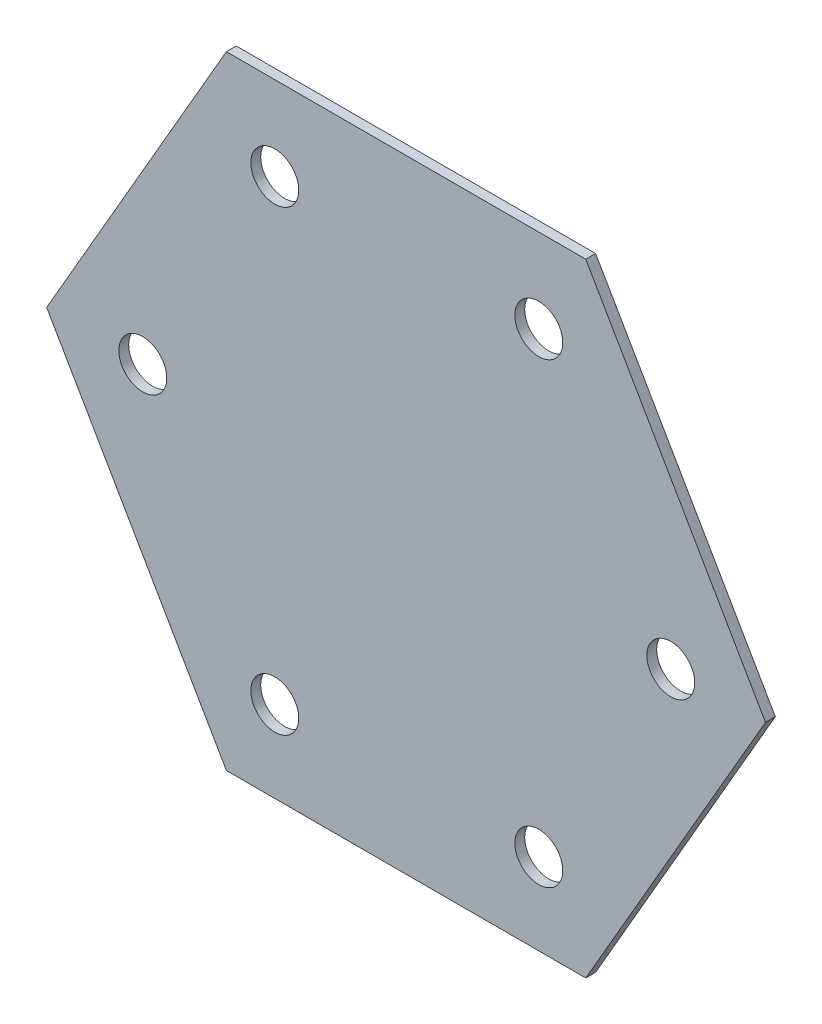
ISO-10303-21;
HEADER;
FILE_DESCRIPTION(('STEP AP214'),'2;1');
FILE_NAME('part.step','',(''),(''),'','','');
FILE_SCHEMA(('AUTOMOTIVE_DESIGN { 1 0 10303 214 1 1 1 1 }'));
ENDSEC;
DATA;
#1=APPLICATION_CONTEXT('core data for automotive mechanical design processes');
#2=APPLICATION_PROTOCOL_DEFINITION('international standard','automotive_design',2000,#1);
#3=PRODUCT_CONTEXT('',#1,'mechanical');
#4=PRODUCT('Part','Part','',(#3));
#5=PRODUCT_RELATED_PRODUCT_CATEGORY('part','',(#4));
#6=PRODUCT_DEFINITION_FORMATION('','',#4);
#7=PRODUCT_DEFINITION_CONTEXT('part definition',#1,'design');
#8=PRODUCT_DEFINITION('design','',#6,#7);
#9=PRODUCT_DEFINITION_SHAPE('','',#8);
#10=(LENGTH_UNIT() NAMED_UNIT(*) SI_UNIT(.MILLI.,.METRE.));
#11=(NAMED_UNIT(*) PLANE_ANGLE_UNIT() SI_UNIT($,.RADIAN.));
#12=(NAMED_UNIT(*) SI_UNIT($,.STERADIAN.) SOLID_ANGLE_UNIT());
#13=UNCERTAINTY_MEASURE_WITH_UNIT(LENGTH_MEASURE(1.E-05),#10,'distance_accuracy_value','');
#14=(GEOMETRIC_REPRESENTATION_CONTEXT(3) GLOBAL_UNCERTAINTY_ASSIGNED_CONTEXT((#13)) GLOBAL_UNIT_ASSIGNED_CONTEXT((#10,
#11,#12)) REPRESENTATION_CONTEXT('',''));
#15=CARTESIAN_POINT('',(0.,0.,0.));
#16=DIRECTION('',(0.,0.,1.));
#17=DIRECTION('',(1.,0.,0.));
#18=AXIS2_PLACEMENT_3D('',#15,#16,#17);
#19=CARTESIAN_POINT('',(22.5,12.989999771118,0.));
#20=DIRECTION('',(0.,0.,-1.));
#21=DIRECTION('',(-1.,0.,0.));
#22=AXIS2_PLACEMENT_3D('',#19,#20,#21);
#23=PLANE('',#22);
#24=CARTESIAN_POINT('',(18.5474864,12.93902416,0.));
#25=DIRECTION('',(0.,0.,-1.));
#26=DIRECTION('',(-1.,0.,0.));
#27=AXIS2_PLACEMENT_3D('',#24,#25,#26);
#28=CIRCLE('',#27,1.00000054);
#29=CARTESIAN_POINT('',(17.54748586,12.93902416,0.));
#30=VERTEX_POINT('',#29);
#31=EDGE_CURVE('E125',#30,#30,#28,.T.);
#32=ORIENTED_EDGE('',*,*,#31,.T.);
#33=EDGE_LOOP('',(#32));
#34=FACE_BOUND('',#33,.T.);
#35=CARTESIAN_POINT('',(13.03865312,22.48086944,0.));
#36=DIRECTION('',(0.,0.,-1.));
#37=DIRECTION('',(-1.,0.,0.));
#38=AXIS2_PLACEMENT_3D('',#35,#36,#37);
#39=CIRCLE('',#38,1.00000054);
#40=CARTESIAN_POINT('',(12.03865258,22.48086944,0.));
#41=VERTEX_POINT('',#40);
#42=EDGE_CURVE('E131',#41,#41,#39,.T.);
#43=ORIENTED_EDGE('',*,*,#42,.T.);
#44=EDGE_LOOP('',(#43));
#45=FACE_BOUND('',#44,.T.);
#46=CARTESIAN_POINT('',(13.03844992,3.39732112,0.));
#47=DIRECTION('',(0.,0.,-1.));
#48=DIRECTION('',(-1.,0.,0.));
#49=AXIS2_PLACEMENT_3D('',#46,#47,#48);
#50=CIRCLE('',#49,1.00000054);
#51=CARTESIAN_POINT('',(12.03844938,3.39732112,0.));
#52=VERTEX_POINT('',#51);
#53=EDGE_CURVE('E140',#52,#52,#50,.T.);
#54=ORIENTED_EDGE('',*,*,#53,.T.);
#55=EDGE_LOOP('',(#54));
#56=FACE_BOUND('',#55,.T.);
#57=CARTESIAN_POINT('',(2.02078336,22.48101168,0.));
#58=DIRECTION('',(0.,0.,-1.));
#59=DIRECTION('',(-1.,0.,0.));
#60=AXIS2_PLACEMENT_3D('',#57,#58,#59);
#61=CIRCLE('',#60,1.00000054);
#62=CARTESIAN_POINT('',(1.02078282,22.48101168,0.));
#63=VERTEX_POINT('',#62);
#64=EDGE_CURVE('E144',#63,#63,#61,.T.);
#65=ORIENTED_EDGE('',*,*,#64,.T.);
#66=EDGE_LOOP('',(#65));
#67=FACE_BOUND('',#66,.T.);
#68=CARTESIAN_POINT('',(-3.48829376,12.93928832,0.));
#69=DIRECTION('',(0.,0.,-1.));
#70=DIRECTION('',(-1.,0.,0.));
#71=AXIS2_PLACEMENT_3D('',#68,#69,#70);
#72=CIRCLE('',#71,1.00000054);
#73=CARTESIAN_POINT('',(-4.4882943,12.93928832,0.));
#74=VERTEX_POINT('',#73);
#75=EDGE_CURVE('E148',#74,#74,#72,.T.);
#76=ORIENTED_EDGE('',*,*,#75,.T.);
#77=EDGE_LOOP('',(#76));
#78=FACE_BOUND('',#77,.T.);
#79=CARTESIAN_POINT('',(2.02053952,3.39746336,0.));
#80=DIRECTION('',(0.,0.,-1.));
#81=DIRECTION('',(-1.,0.,0.));
#82=AXIS2_PLACEMENT_3D('',#79,#80,#81);
#83=CIRCLE('',#82,1.00000054);
#84=CARTESIAN_POINT('',(1.02053898,3.39746336,0.));
#85=VERTEX_POINT('',#84);
#86=EDGE_CURVE('E23',#85,#85,#83,.T.);
#87=ORIENTED_EDGE('',*,*,#86,.T.);
#88=EDGE_LOOP('',(#87));
#89=FACE_BOUND('',#88,.T.);
#90=DIRECTION('',(1.,0.,0.));
#91=VECTOR('',#90,1.);
#92=CARTESIAN_POINT('',(15.,25.981000900269,0.));
#93=LINE('',#92,#91);
#94=CARTESIAN_POINT('',(14.9999999999999,25.9810009002689,0.));
#95=VERTEX_POINT('',#94);
#96=CARTESIAN_POINT('',(0.,25.981000900269,0.));
#97=VERTEX_POINT('',#96);
#98=EDGE_CURVE('E163',#95,#97,#93,.F.);
#99=ORIENTED_EDGE('',*,*,#98,.T.);
#100=DIRECTION('',(0.499982100586129,0.866035737769223,0.));
#101=VECTOR('',#100,1.);
#102=CARTESIAN_POINT('',(0.,25.981000900269,0.));
#103=LINE('',#102,#101);
#104=CARTESIAN_POINT('',(-7.50000000000011,12.9899997711181,0.));
#105=VERTEX_POINT('',#104);
#106=EDGE_CURVE('E169',#97,#105,#103,.F.);
#107=ORIENTED_EDGE('',*,*,#106,.T.);
#108=DIRECTION('',(-0.500011006970785,0.866019048813628,0.));
#109=VECTOR('',#108,1.);
#110=CARTESIAN_POINT('',(-7.5,12.989999771118,0.));
#111=LINE('',#110,#109);
#112=CARTESIAN_POINT('',(1.03085940650496E-12,5.97496044059143E-13,0.));
#113=VERTEX_POINT('',#112);
#114=EDGE_CURVE('E73',#105,#113,#111,.F.);
#115=ORIENTED_EDGE('',*,*,#114,.T.);
#116=DIRECTION('',(1.,0.,0.));
#117=VECTOR('',#116,1.);
#118=CARTESIAN_POINT('',(0.,0.,0.));
#119=LINE('',#118,#117);
#120=CARTESIAN_POINT('',(15.,0.,0.));
#121=VERTEX_POINT('',#120);
#122=EDGE_CURVE('E75',#113,#121,#119,.T.);
#123=ORIENTED_EDGE('',*,*,#122,.T.);
#124=DIRECTION('',(-0.500011006970785,-0.866019048813628,0.));
#125=VECTOR('',#124,1.);
#126=CARTESIAN_POINT('',(15.,0.,0.));
#127=LINE('',#126,#125);
#128=CARTESIAN_POINT('',(22.5000000000021,12.9899997711168,0.));
#129=VERTEX_POINT('',#128);
#130=EDGE_CURVE('E77',#121,#129,#127,.F.);
#131=ORIENTED_EDGE('',*,*,#130,.T.);
#132=DIRECTION('',(0.499982100586129,-0.866035737769223,0.));
#133=VECTOR('',#132,1.);
#134=CARTESIAN_POINT('',(22.5,12.989999771118,0.));
#135=LINE('',#134,#133);
#136=EDGE_CURVE('E157',#129,#95,#135,.F.);
#137=ORIENTED_EDGE('',*,*,#136,.T.);
#138=EDGE_LOOP('',(#99,#107,#115,#123,#131,#137));
#139=FACE_BOUND('',#138,.T.);
#140=ADVANCED_FACE('F20',(#34,#45,#56,#67,#78,#89,#139),#23,.F.);
#141=CARTESIAN_POINT('',(15.,0.,-0.41148));
#142=DIRECTION('',(-0.866019048813628,0.500011006970785,0.));
#143=DIRECTION('',(-0.500011006970785,-0.866019048813628,0.));
#144=AXIS2_PLACEMENT_3D('',#141,#142,#143);
#145=PLANE('',#144);
#146=DIRECTION('',(0.,0.,1.));
#147=VECTOR('',#146,1.);
#148=CARTESIAN_POINT('',(22.5,12.989999771118,-0.41148));
#149=LINE('',#148,#147);
#150=CARTESIAN_POINT('',(22.5000000000021,12.9899997711168,-0.41148));
#151=VERTEX_POINT('',#150);
#152=EDGE_CURVE('E89',#151,#129,#149,.T.);
#153=ORIENTED_EDGE('',*,*,#152,.T.);
#154=ORIENTED_EDGE('',*,*,#130,.F.);
#155=DIRECTION('',(0.,0.,1.));
#156=VECTOR('',#155,1.);
#157=CARTESIAN_POINT('',(15.,0.,-0.41148));
#158=LINE('',#157,#156);
#159=CARTESIAN_POINT('',(15.,0.,-0.41148));
#160=VERTEX_POINT('',#159);
#161=EDGE_CURVE('E83',#121,#160,#158,.F.);
#162=ORIENTED_EDGE('',*,*,#161,.T.);
#163=DIRECTION('',(-0.50001100697051,-0.866019048813787,0.));
#164=VECTOR('',#163,1.);
#165=CARTESIAN_POINT('',(22.5,12.989999771118,-0.41148));
#166=LINE('',#165,#164);
#167=EDGE_CURVE('E130',#151,#160,#166,.T.);
#168=ORIENTED_EDGE('',*,*,#167,.F.);
#169=EDGE_LOOP('',(#153,#154,#162,#168));
#170=FACE_BOUND('',#169,.T.);
#171=ADVANCED_FACE('F86',(#170),#145,.F.);
#172=CARTESIAN_POINT('',(0.,0.,-0.41148));
#173=DIRECTION('',(0.,1.,0.));
#174=DIRECTION('',(0.,0.,1.));
#175=AXIS2_PLACEMENT_3D('',#172,#173,#174);
#176=PLANE('',#175);
#177=ORIENTED_EDGE('',*,*,#161,.F.);
#178=ORIENTED_EDGE('',*,*,#122,.F.);
#179=DIRECTION('',(0.,0.,1.));
#180=VECTOR('',#179,1.);
#181=CARTESIAN_POINT('',(4.13384604325273E-12,2.38351005599213E-12,-0.41148));
#182=LINE('',#181,#180);
#183=CARTESIAN_POINT('',(1.03259413952806E-12,5.958194172906E-13,-0.41148));
#184=VERTEX_POINT('',#183);
#185=EDGE_CURVE('E101',#113,#184,#182,.F.);
#186=ORIENTED_EDGE('',*,*,#185,.T.);
#187=DIRECTION('',(-1.,0.,0.));
#188=VECTOR('',#187,1.);
#189=CARTESIAN_POINT('',(22.5,0.,-0.41148));
#190=LINE('',#189,#188);
#191=EDGE_CURVE('E95',#160,#184,#190,.T.);
#192=ORIENTED_EDGE('',*,*,#191,.F.);
#193=EDGE_LOOP('',(#177,#178,#186,#192));
#194=FACE_BOUND('',#193,.T.);
#195=ADVANCED_FACE('F93',(#194),#176,.F.);
#196=CARTESIAN_POINT('',(-7.5,12.989999771118,-0.41148));
#197=DIRECTION('',(0.866019048813628,0.500011006970785,0.));
#198=DIRECTION('',(-0.500011006970785,0.866019048813628,0.));
#199=AXIS2_PLACEMENT_3D('',#196,#197,#198);
#200=PLANE('',#199);
#201=ORIENTED_EDGE('',*,*,#185,.F.);
#202=ORIENTED_EDGE('',*,*,#114,.F.);
#203=DIRECTION('',(0.,0.,1.));
#204=VECTOR('',#203,1.);
#205=CARTESIAN_POINT('',(-7.50000000000045,12.9899997711183,-0.41148));
#206=LINE('',#205,#204);
#207=CARTESIAN_POINT('',(-7.50000000000011,12.9899997711181,-0.41148));
#208=VERTEX_POINT('',#207);
#209=EDGE_CURVE('E166',#105,#208,#206,.F.);
#210=ORIENTED_EDGE('',*,*,#209,.T.);
#211=DIRECTION('',(-0.50001100697051,0.866019048813787,0.));
#212=VECTOR('',#211,1.);
#213=CARTESIAN_POINT('',(0.,0.,-0.41148));
#214=LINE('',#213,#212);
#215=EDGE_CURVE('E175',#184,#208,#214,.T.);
#216=ORIENTED_EDGE('',*,*,#215,.F.);
#217=EDGE_LOOP('',(#201,#202,#210,#216));
#218=FACE_BOUND('',#217,.T.);
#219=ADVANCED_FACE('F176',(#218),#200,.F.);
#220=CARTESIAN_POINT('',(0.,25.981000900269,-0.41148));
#221=DIRECTION('',(0.866035737769223,-0.499982100586129,0.));
#222=DIRECTION('',(0.499982100586129,0.866035737769223,0.));
#223=AXIS2_PLACEMENT_3D('',#220,#221,#222);
#224=PLANE('',#223);
#225=ORIENTED_EDGE('',*,*,#209,.F.);
#226=ORIENTED_EDGE('',*,*,#106,.F.);
#227=DIRECTION('',(0.,0.,-1.));
#228=VECTOR('',#227,1.);
#229=CARTESIAN_POINT('',(0.,25.981000900269,-0.41148));
#230=LINE('',#229,#228);
#231=CARTESIAN_POINT('',(0.,25.981000900269,-0.41148));
#232=VERTEX_POINT('',#231);
#233=EDGE_CURVE('E158',#97,#232,#230,.T.);
#234=ORIENTED_EDGE('',*,*,#233,.T.);
#235=DIRECTION('',(0.499982100586099,0.86603573776924,0.));
#236=VECTOR('',#235,1.);
#237=CARTESIAN_POINT('',(-7.5,12.989999771118,-0.41148));
#238=LINE('',#237,#236);
#239=EDGE_CURVE('E182',#208,#232,#238,.T.);
#240=ORIENTED_EDGE('',*,*,#239,.F.);
#241=EDGE_LOOP('',(#225,#226,#234,#240));
#242=FACE_BOUND('',#241,.T.);
#243=ADVANCED_FACE('F210',(#242),#224,.F.);
#244=CARTESIAN_POINT('',(15.,25.981000900269,-0.41148));
#245=DIRECTION('',(0.,-1.,0.));
#246=DIRECTION('',(0.,0.,-1.));
#247=AXIS2_PLACEMENT_3D('',#244,#245,#246);
#248=PLANE('',#247);
#249=ORIENTED_EDGE('',*,*,#233,.F.);
#250=ORIENTED_EDGE('',*,*,#98,.F.);
#251=DIRECTION('',(0.,0.,1.));
#252=VECTOR('',#251,1.);
#253=CARTESIAN_POINT('',(14.9999999999996,25.9810009002687,-0.41148));
#254=LINE('',#253,#252);
#255=CARTESIAN_POINT('',(14.9999999999999,25.9810009002689,-0.41148));
#256=VERTEX_POINT('',#255);
#257=EDGE_CURVE('E40',#95,#256,#254,.F.);
#258=ORIENTED_EDGE('',*,*,#257,.T.);
#259=DIRECTION('',(-1.,0.,0.));
#260=VECTOR('',#259,1.);
#261=CARTESIAN_POINT('',(22.5,25.981000900269,-0.41148));
#262=LINE('',#261,#260);
#263=EDGE_CURVE('E202',#232,#256,#262,.F.);
#264=ORIENTED_EDGE('',*,*,#263,.F.);
#265=EDGE_LOOP('',(#249,#250,#258,#264));
#266=FACE_BOUND('',#265,.T.);
#267=ADVANCED_FACE('F199',(#266),#248,.F.);
#268=CARTESIAN_POINT('',(22.5,12.989999771118,-0.41148));
#269=DIRECTION('',(-0.866035737769223,-0.499982100586129,0.));
#270=DIRECTION('',(0.499982100586129,-0.866035737769223,0.));
#271=AXIS2_PLACEMENT_3D('',#268,#269,#270);
#272=PLANE('',#271);
#273=ORIENTED_EDGE('',*,*,#257,.F.);
#274=ORIENTED_EDGE('',*,*,#136,.F.);
#275=ORIENTED_EDGE('',*,*,#152,.F.);
#276=DIRECTION('',(0.499982100586099,-0.86603573776924,0.));
#277=VECTOR('',#276,1.);
#278=CARTESIAN_POINT('',(15.,25.981000900269,-0.41148));
#279=LINE('',#278,#277);
#280=EDGE_CURVE('E124',#256,#151,#279,.T.);
#281=ORIENTED_EDGE('',*,*,#280,.F.);
#282=EDGE_LOOP('',(#273,#274,#275,#281));
#283=FACE_BOUND('',#282,.T.);
#284=ADVANCED_FACE('F200',(#283),#272,.F.);
#285=CARTESIAN_POINT('',(2.02053952,3.39746336,-0.41148));
#286=DIRECTION('',(0.,0.,-1.));
#287=DIRECTION('',(-1.,0.,0.));
#288=AXIS2_PLACEMENT_3D('',#285,#286,#287);
#289=CYLINDRICAL_SURFACE('',#288,1.00000054);
#290=ORIENTED_EDGE('',*,*,#86,.F.);
#291=EDGE_LOOP('',(#290));
#292=FACE_BOUND('',#291,.T.);
#293=CARTESIAN_POINT('',(2.02053952,3.39746336,-0.41148));
#294=DIRECTION('',(0.,0.,-1.));
#295=DIRECTION('',(-1.,0.,0.));
#296=AXIS2_PLACEMENT_3D('',#293,#294,#295);
#297=CIRCLE('',#296,1.00000054);
#298=CARTESIAN_POINT('',(1.02053898,3.39746336,-0.41148));
#299=VERTEX_POINT('',#298);
#300=EDGE_CURVE('E120',#299,#299,#297,.F.);
#301=ORIENTED_EDGE('',*,*,#300,.F.);
#302=EDGE_LOOP('',(#301));
#303=FACE_BOUND('',#302,.T.);
#304=ADVANCED_FACE('F246',(#292,#303),#289,.F.);
#305=CARTESIAN_POINT('',(-3.48829376,12.93928832,-0.41148));
#306=DIRECTION('',(0.,0.,-1.));
#307=DIRECTION('',(-1.,0.,0.));
#308=AXIS2_PLACEMENT_3D('',#305,#306,#307);
#309=CYLINDRICAL_SURFACE('',#308,1.00000054);
#310=ORIENTED_EDGE('',*,*,#75,.F.);
#311=EDGE_LOOP('',(#310));
#312=FACE_BOUND('',#311,.T.);
#313=CARTESIAN_POINT('',(-3.48829376,12.93928832,-0.41148));
#314=DIRECTION('',(0.,0.,-1.));
#315=DIRECTION('',(-1.,0.,0.));
#316=AXIS2_PLACEMENT_3D('',#313,#314,#315);
#317=CIRCLE('',#316,1.00000054);
#318=CARTESIAN_POINT('',(-4.4882943,12.93928832,-0.41148));
#319=VERTEX_POINT('',#318);
#320=EDGE_CURVE('E116',#319,#319,#317,.F.);
#321=ORIENTED_EDGE('',*,*,#320,.F.);
#322=EDGE_LOOP('',(#321));
#323=FACE_BOUND('',#322,.T.);
#324=ADVANCED_FACE('F242',(#312,#323),#309,.F.);
#325=CARTESIAN_POINT('',(2.02078336,22.48101168,-0.41148));
#326=DIRECTION('',(0.,0.,-1.));
#327=DIRECTION('',(-1.,0.,0.));
#328=AXIS2_PLACEMENT_3D('',#325,#326,#327);
#329=CYLINDRICAL_SURFACE('',#328,1.00000054);
#330=ORIENTED_EDGE('',*,*,#64,.F.);
#331=EDGE_LOOP('',(#330));
#332=FACE_BOUND('',#331,.T.);
#333=CARTESIAN_POINT('',(2.02078336,22.48101168,-0.41148));
#334=DIRECTION('',(0.,0.,-1.));
#335=DIRECTION('',(-1.,0.,0.));
#336=AXIS2_PLACEMENT_3D('',#333,#334,#335);
#337=CIRCLE('',#336,1.00000054);
#338=CARTESIAN_POINT('',(1.02078282,22.48101168,-0.41148));
#339=VERTEX_POINT('',#338);
#340=EDGE_CURVE('E112',#339,#339,#337,.F.);
#341=ORIENTED_EDGE('',*,*,#340,.F.);
#342=EDGE_LOOP('',(#341));
#343=FACE_BOUND('',#342,.T.);
#344=ADVANCED_FACE('F238',(#332,#343),#329,.F.);
#345=CARTESIAN_POINT('',(13.03844992,3.39732112,-0.41148));
#346=DIRECTION('',(0.,0.,-1.));
#347=DIRECTION('',(-1.,0.,0.));
#348=AXIS2_PLACEMENT_3D('',#345,#346,#347);
#349=CYLINDRICAL_SURFACE('',#348,1.00000054);
#350=ORIENTED_EDGE('',*,*,#53,.F.);
#351=EDGE_LOOP('',(#350));
#352=FACE_BOUND('',#351,.T.);
#353=CARTESIAN_POINT('',(13.03844992,3.39732112,-0.41148));
#354=DIRECTION('',(0.,0.,-1.));
#355=DIRECTION('',(-1.,0.,0.));
#356=AXIS2_PLACEMENT_3D('',#353,#354,#355);
#357=CIRCLE('',#356,1.00000054);
#358=CARTESIAN_POINT('',(12.03844938,3.39732112,-0.41148));
#359=VERTEX_POINT('',#358);
#360=EDGE_CURVE('E108',#359,#359,#357,.F.);
#361=ORIENTED_EDGE('',*,*,#360,.F.);
#362=EDGE_LOOP('',(#361));
#363=FACE_BOUND('',#362,.T.);
#364=ADVANCED_FACE('F234',(#352,#363),#349,.F.);
#365=CARTESIAN_POINT('',(13.03865312,22.48086944,-0.41148));
#366=DIRECTION('',(0.,0.,-1.));
#367=DIRECTION('',(-1.,0.,0.));
#368=AXIS2_PLACEMENT_3D('',#365,#366,#367);
#369=CYLINDRICAL_SURFACE('',#368,1.00000054);
#370=ORIENTED_EDGE('',*,*,#42,.F.);
#371=EDGE_LOOP('',(#370));
#372=FACE_BOUND('',#371,.T.);
#373=CARTESIAN_POINT('',(13.03865312,22.48086944,-0.41148));
#374=DIRECTION('',(0.,0.,-1.));
#375=DIRECTION('',(-1.,0.,0.));
#376=AXIS2_PLACEMENT_3D('',#373,#374,#375);
#377=CIRCLE('',#376,1.00000054);
#378=CARTESIAN_POINT('',(12.03865258,22.48086944,-0.41148));
#379=VERTEX_POINT('',#378);
#380=EDGE_CURVE('E31',#379,#379,#377,.F.);
#381=ORIENTED_EDGE('',*,*,#380,.F.);
#382=EDGE_LOOP('',(#381));
#383=FACE_BOUND('',#382,.T.);
#384=ADVANCED_FACE('F227',(#372,#383),#369,.F.);
#385=CARTESIAN_POINT('',(18.5474864,12.93902416,-0.41148));
#386=DIRECTION('',(0.,0.,-1.));
#387=DIRECTION('',(-1.,0.,0.));
#388=AXIS2_PLACEMENT_3D('',#385,#386,#387);
#389=CYLINDRICAL_SURFACE('',#388,1.00000054);
#390=ORIENTED_EDGE('',*,*,#31,.F.);
#391=EDGE_LOOP('',(#390));
#392=FACE_BOUND('',#391,.T.);
#393=CARTESIAN_POINT('',(18.5474864,12.93902416,-0.41148));
#394=DIRECTION('',(0.,0.,-1.));
#395=DIRECTION('',(-1.,0.,0.));
#396=AXIS2_PLACEMENT_3D('',#393,#394,#395);
#397=CIRCLE('',#396,1.00000054);
#398=CARTESIAN_POINT('',(17.54748586,12.93902416,-0.41148));
#399=VERTEX_POINT('',#398);
#400=EDGE_CURVE('E12',#399,#399,#397,.F.);
#401=ORIENTED_EDGE('',*,*,#400,.F.);
#402=EDGE_LOOP('',(#401));
#403=FACE_BOUND('',#402,.T.);
#404=ADVANCED_FACE('F221',(#392,#403),#389,.F.);
#405=CARTESIAN_POINT('',(22.5,12.989999771118,-0.41148));
#406=DIRECTION('',(0.,0.,-1.));
#407=DIRECTION('',(-1.,0.,0.));
#408=AXIS2_PLACEMENT_3D('',#405,#406,#407);
#409=PLANE('',#408);
#410=ORIENTED_EDGE('',*,*,#400,.T.);
#411=EDGE_LOOP('',(#410));
#412=FACE_BOUND('',#411,.T.);
#413=ORIENTED_EDGE('',*,*,#380,.T.);
#414=EDGE_LOOP('',(#413));
#415=FACE_BOUND('',#414,.T.);
#416=ORIENTED_EDGE('',*,*,#360,.T.);
#417=EDGE_LOOP('',(#416));
#418=FACE_BOUND('',#417,.T.);
#419=ORIENTED_EDGE('',*,*,#340,.T.);
#420=EDGE_LOOP('',(#419));
#421=FACE_BOUND('',#420,.T.);
#422=ORIENTED_EDGE('',*,*,#320,.T.);
#423=EDGE_LOOP('',(#422));
#424=FACE_BOUND('',#423,.T.);
#425=ORIENTED_EDGE('',*,*,#300,.T.);
#426=EDGE_LOOP('',(#425));
#427=FACE_BOUND('',#426,.T.);
#428=ORIENTED_EDGE('',*,*,#263,.T.);
#429=ORIENTED_EDGE('',*,*,#280,.T.);
#430=ORIENTED_EDGE('',*,*,#167,.T.);
#431=ORIENTED_EDGE('',*,*,#191,.T.);
#432=ORIENTED_EDGE('',*,*,#215,.T.);
#433=ORIENTED_EDGE('',*,*,#239,.T.);
#434=EDGE_LOOP('',(#428,#429,#430,#431,#432,#433));
#435=FACE_BOUND('',#434,.T.);
#436=ADVANCED_FACE('F185',(#412,#415,#418,#421,#424,#427,#435),#409,.T.);
#437=CLOSED_SHELL('',(#140,#171,#195,#219,#243,#267,#284,#304,#324,#344,#364,#384,#404,#436));
#438=MANIFOLD_SOLID_BREP('B1',#437);
#439=ADVANCED_BREP_SHAPE_REPRESENTATION('',(#18,#438),#14);
#440=SHAPE_DEFINITION_REPRESENTATION(#9,#439);
ENDSEC;
END-ISO-10303-21;
